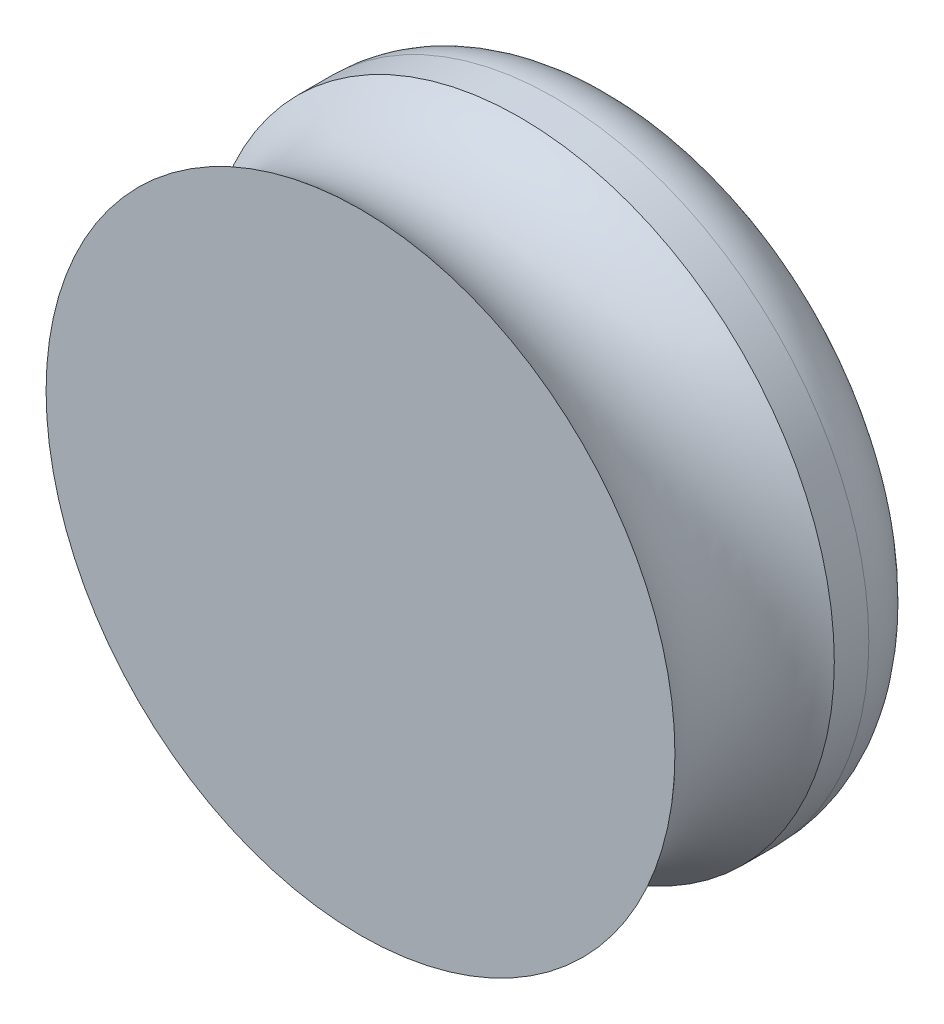
ISO-10303-21;
HEADER;
FILE_DESCRIPTION(('STEP AP214'),'2;1');
FILE_NAME('part.step','',(''),(''),'','','');
FILE_SCHEMA(('AUTOMOTIVE_DESIGN { 1 0 10303 214 1 1 1 1 }'));
ENDSEC;
DATA;
#1=APPLICATION_CONTEXT('core data for automotive mechanical design processes');
#2=APPLICATION_PROTOCOL_DEFINITION('international standard','automotive_design',2000,#1);
#3=PRODUCT_CONTEXT('',#1,'mechanical');
#4=PRODUCT('Part','Part','',(#3));
#5=PRODUCT_RELATED_PRODUCT_CATEGORY('part','',(#4));
#6=PRODUCT_DEFINITION_FORMATION('','',#4);
#7=PRODUCT_DEFINITION_CONTEXT('part definition',#1,'design');
#8=PRODUCT_DEFINITION('design','',#6,#7);
#9=PRODUCT_DEFINITION_SHAPE('','',#8);
#10=(LENGTH_UNIT() NAMED_UNIT(*) SI_UNIT(.MILLI.,.METRE.));
#11=(NAMED_UNIT(*) PLANE_ANGLE_UNIT() SI_UNIT($,.RADIAN.));
#12=(NAMED_UNIT(*) SI_UNIT($,.STERADIAN.) SOLID_ANGLE_UNIT());
#13=UNCERTAINTY_MEASURE_WITH_UNIT(LENGTH_MEASURE(1.E-05),#10,'distance_accuracy_value','');
#14=(GEOMETRIC_REPRESENTATION_CONTEXT(3) GLOBAL_UNCERTAINTY_ASSIGNED_CONTEXT((#13)) GLOBAL_UNIT_ASSIGNED_CONTEXT((#10,
#11,#12)) REPRESENTATION_CONTEXT('',''));
#15=CARTESIAN_POINT('',(0.,0.,0.));
#16=DIRECTION('',(0.,0.,1.));
#17=DIRECTION('',(1.,0.,0.));
#18=AXIS2_PLACEMENT_3D('',#15,#16,#17);
#19=CARTESIAN_POINT('',(-101.008303397109,-58.0021041199523,-5.50000000000028));
#20=DIRECTION('',(0.,0.,-1.));
#21=DIRECTION('',(-1.,0.,0.));
#22=AXIS2_PLACEMENT_3D('',#19,#20,#21);
#23=PLANE('',#22);
#24=CARTESIAN_POINT('',(-102.183303397109,-58.0021041199525,-5.50000000000028));
#25=DIRECTION('',(0.,0.,-1.));
#26=DIRECTION('',(-1.,0.,0.));
#27=AXIS2_PLACEMENT_3D('',#24,#25,#26);
#28=CIRCLE('',#27,2.35);
#29=CARTESIAN_POINT('',(-104.533303397109,-58.0021041199525,-5.50000000000028));
#30=VERTEX_POINT('',#29);
#31=EDGE_CURVE('E19',#30,#30,#28,.F.);
#32=ORIENTED_EDGE('',*,*,#31,.F.);
#33=EDGE_LOOP('',(#32));
#34=FACE_BOUND('',#33,.T.);
#35=ADVANCED_FACE('F15',(#34),#23,.T.);
#36=CARTESIAN_POINT('',(-102.183303397109,-58.0021041199525,-5.50000000000028));
#37=DIRECTION('',(0.,0.,-1.));
#38=DIRECTION('',(-1.,0.,0.));
#39=AXIS2_PLACEMENT_3D('',#36,#37,#38);
#40=CYLINDRICAL_SURFACE('',#39,2.35);
#41=ORIENTED_EDGE('',*,*,#31,.T.);
#42=EDGE_LOOP('',(#41));
#43=FACE_BOUND('',#42,.T.);
#44=CARTESIAN_POINT('',(-102.183303397109,-58.0021041199525,-5.38000000000028));
#45=DIRECTION('',(0.,0.,1.));
#46=DIRECTION('',(1.,0.,0.));
#47=AXIS2_PLACEMENT_3D('',#44,#45,#46);
#48=CIRCLE('',#47,2.34999999999999);
#49=CARTESIAN_POINT('',(-99.833303397109,-58.0021041199525,-5.38000000000028));
#50=VERTEX_POINT('',#49);
#51=EDGE_CURVE('E30',#50,#50,#48,.T.);
#52=ORIENTED_EDGE('',*,*,#51,.F.);
#53=EDGE_LOOP('',(#52));
#54=FACE_BOUND('',#53,.T.);
#55=ADVANCED_FACE('F41',(#43,#54),#40,.T.);
#56=CARTESIAN_POINT('',(-102.183303397109,-58.0021041199525,-4.70000000000028));
#57=DIRECTION('',(0.,0.,-1.));
#58=DIRECTION('',(-1.,0.,0.));
#59=AXIS2_PLACEMENT_3D('',#56,#57,#58);
#60=TOROIDAL_SURFACE('',#59,2.35,0.680000000000003);
#61=ORIENTED_EDGE('',*,*,#51,.T.);
#62=EDGE_LOOP('',(#61));
#63=FACE_BOUND('',#62,.T.);
#64=CARTESIAN_POINT('',(-102.183303397109,-58.0021041199525,-4.70000000000029));
#65=DIRECTION('',(0.,0.,1.));
#66=DIRECTION('',(1.,0.,0.));
#67=AXIS2_PLACEMENT_3D('',#64,#65,#66);
#68=CIRCLE('',#67,3.03);
#69=CARTESIAN_POINT('',(-99.153303397109,-58.0021041199525,-4.70000000000029));
#70=VERTEX_POINT('',#69);
#71=EDGE_CURVE('E27',#70,#70,#68,.T.);
#72=ORIENTED_EDGE('',*,*,#71,.F.);
#73=EDGE_LOOP('',(#72));
#74=FACE_BOUND('',#73,.T.);
#75=ADVANCED_FACE('F39',(#63,#74),#60,.T.);
#76=CARTESIAN_POINT('',(-102.183303397109,-58.0021041199525,-4.50980017690064));
#77=DIRECTION('',(0.,0.,1.));
#78=DIRECTION('',(1.,0.,0.));
#79=AXIS2_PLACEMENT_3D('',#76,#77,#78);
#80=CYLINDRICAL_SURFACE('',#79,3.03);
#81=ORIENTED_EDGE('',*,*,#71,.T.);
#82=EDGE_LOOP('',(#81));
#83=FACE_BOUND('',#82,.T.);
#84=CARTESIAN_POINT('',(-102.183303397109,-58.0021041199525,-4.36765488154327));
#85=DIRECTION('',(0.,0.,-1.));
#86=DIRECTION('',(-1.,0.,0.));
#87=AXIS2_PLACEMENT_3D('',#84,#85,#86);
#88=CIRCLE('',#87,3.03);
#89=CARTESIAN_POINT('',(-105.213303397109,-58.0021041199525,-4.36765488154327));
#90=VERTEX_POINT('',#89);
#91=EDGE_CURVE('E23',#90,#90,#88,.T.);
#92=ORIENTED_EDGE('',*,*,#91,.T.);
#93=EDGE_LOOP('',(#92));
#94=FACE_BOUND('',#93,.T.);
#95=ADVANCED_FACE('F36',(#83,#94),#80,.T.);
#96=CARTESIAN_POINT('',(-102.183303397109,-58.0021041199525,-3.599666961189));
#97=DIRECTION('',(0.,0.,-1.));
#98=DIRECTION('',(0.,1.,0.));
#99=AXIS2_PLACEMENT_3D('',#96,#97,#98);
#100=TOROIDAL_SURFACE('',#99,3.87090333435164,1.13882565106946);
#101=ORIENTED_EDGE('',*,*,#91,.F.);
#102=EDGE_LOOP('',(#101));
#103=FACE_BOUND('',#102,.T.);
#104=CARTESIAN_POINT('',(-102.183303397109,-58.0021041199525,-2.8316790408346));
#105=DIRECTION('',(0.,0.,-1.));
#106=DIRECTION('',(-1.,0.,0.));
#107=AXIS2_PLACEMENT_3D('',#104,#105,#106);
#108=CIRCLE('',#107,3.03000000000012);
#109=CARTESIAN_POINT('',(-105.213303397109,-58.0021041199525,-2.8316790408346));
#110=VERTEX_POINT('',#109);
#111=EDGE_CURVE('E10',#110,#110,#108,.T.);
#112=ORIENTED_EDGE('',*,*,#111,.T.);
#113=EDGE_LOOP('',(#112));
#114=FACE_BOUND('',#113,.T.);
#115=ADVANCED_FACE('F17',(#103,#114),#100,.F.);
#116=CARTESIAN_POINT('',(-102.183303397109,-58.0021041199525,-2.8316790408346));
#117=DIRECTION('',(0.,0.,-1.));
#118=DIRECTION('',(-1.,0.,0.));
#119=AXIS2_PLACEMENT_3D('',#116,#117,#118);
#120=PLANE('',#119);
#121=ORIENTED_EDGE('',*,*,#111,.F.);
#122=EDGE_LOOP('',(#121));
#123=FACE_BOUND('',#122,.T.);
#124=ADVANCED_FACE('F52',(#123),#120,.F.);
#125=CLOSED_SHELL('',(#35,#55,#75,#95,#115,#124));
#126=MANIFOLD_SOLID_BREP('B1',#125);
#127=ADVANCED_BREP_SHAPE_REPRESENTATION('',(#18,#126),#14);
#128=SHAPE_DEFINITION_REPRESENTATION(#9,#127);
ENDSEC;
END-ISO-10303-21;
